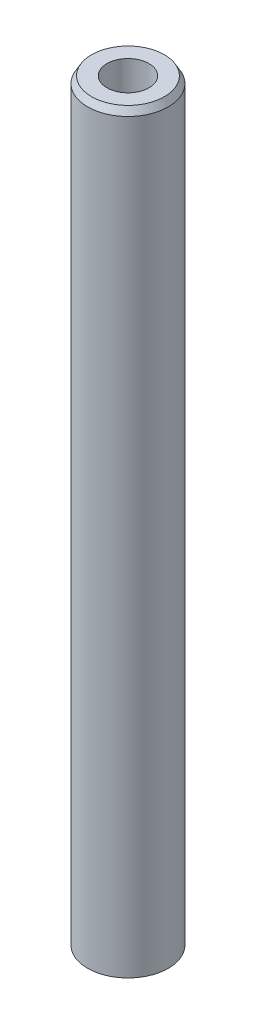
ISO-10303-21;
HEADER;
FILE_DESCRIPTION(('STEP AP214'),'2;1');
FILE_NAME('part.step','',(''),(''),'','','');
FILE_SCHEMA(('AUTOMOTIVE_DESIGN { 1 0 10303 214 1 1 1 1 }'));
ENDSEC;
DATA;
#1=APPLICATION_CONTEXT('core data for automotive mechanical design processes');
#2=APPLICATION_PROTOCOL_DEFINITION('international standard','automotive_design',2000,#1);
#3=PRODUCT_CONTEXT('',#1,'mechanical');
#4=PRODUCT('Part','Part','',(#3));
#5=PRODUCT_RELATED_PRODUCT_CATEGORY('part','',(#4));
#6=PRODUCT_DEFINITION_FORMATION('','',#4);
#7=PRODUCT_DEFINITION_CONTEXT('part definition',#1,'design');
#8=PRODUCT_DEFINITION('design','',#6,#7);
#9=PRODUCT_DEFINITION_SHAPE('','',#8);
#10=(LENGTH_UNIT() NAMED_UNIT(*) SI_UNIT(.MILLI.,.METRE.));
#11=(NAMED_UNIT(*) PLANE_ANGLE_UNIT() SI_UNIT($,.RADIAN.));
#12=(NAMED_UNIT(*) SI_UNIT($,.STERADIAN.) SOLID_ANGLE_UNIT());
#13=UNCERTAINTY_MEASURE_WITH_UNIT(LENGTH_MEASURE(1.E-05),#10,'distance_accuracy_value','');
#14=(GEOMETRIC_REPRESENTATION_CONTEXT(3) GLOBAL_UNCERTAINTY_ASSIGNED_CONTEXT((#13)) GLOBAL_UNIT_ASSIGNED_CONTEXT((#10,
#11,#12)) REPRESENTATION_CONTEXT('',''));
#15=CARTESIAN_POINT('',(0.,0.,0.));
#16=DIRECTION('',(0.,0.,1.));
#17=DIRECTION('',(1.,0.,0.));
#18=AXIS2_PLACEMENT_3D('',#15,#16,#17);
#19=CARTESIAN_POINT('',(0.,93.8489881506741,0.));
#20=DIRECTION('',(0.,-1.,0.));
#21=DIRECTION('',(0.,0.,-1.));
#22=AXIS2_PLACEMENT_3D('',#19,#20,#21);
#23=CYLINDRICAL_SURFACE('',#22,5.);
#24=CARTESIAN_POINT('',(0.,93.0018814613699,0.));
#25=DIRECTION('',(0.,1.,0.));
#26=DIRECTION('',(0.,0.,1.));
#27=AXIS2_PLACEMENT_3D('',#24,#25,#26);
#28=CIRCLE('',#27,5.);
#29=CARTESIAN_POINT('',(0.,93.0018814613699,5.));
#30=VERTEX_POINT('',#29);
#31=EDGE_CURVE('E50',#30,#30,#28,.F.);
#32=ORIENTED_EDGE('',*,*,#31,.T.);
#33=EDGE_LOOP('',(#32));
#34=FACE_BOUND('',#33,.T.);
#35=CARTESIAN_POINT('',(0.,0.489077275102071,0.));
#36=DIRECTION('',(0.,1.,0.));
#37=DIRECTION('',(0.,0.,1.));
#38=AXIS2_PLACEMENT_3D('',#35,#36,#37);
#39=CIRCLE('',#38,5.);
#40=CARTESIAN_POINT('',(0.,0.489077275102071,5.));
#41=VERTEX_POINT('',#40);
#42=EDGE_CURVE('E51',#41,#41,#39,.T.);
#43=ORIENTED_EDGE('',*,*,#42,.T.);
#44=EDGE_LOOP('',(#43));
#45=FACE_BOUND('',#44,.T.);
#46=ADVANCED_FACE('F39',(#34,#45),#23,.T.);
#47=CARTESIAN_POINT('',(0.,93.8489881506741,0.));
#48=DIRECTION('',(0.,1.,0.));
#49=DIRECTION('',(0.,0.,1.));
#50=AXIS2_PLACEMENT_3D('',#47,#48,#49);
#51=PLANE('',#50);
#52=CARTESIAN_POINT('',(0.,93.8489881506741,0.));
#53=DIRECTION('',(0.,1.,0.));
#54=DIRECTION('',(0.,0.,1.));
#55=AXIS2_PLACEMENT_3D('',#52,#53,#54);
#56=CIRCLE('',#55,4.51092272489793);
#57=CARTESIAN_POINT('',(0.,93.8489881506741,4.51092272489793));
#58=VERTEX_POINT('',#57);
#59=EDGE_CURVE('E54',#58,#58,#56,.T.);
#60=ORIENTED_EDGE('',*,*,#59,.T.);
#61=EDGE_LOOP('',(#60));
#62=FACE_BOUND('',#61,.T.);
#63=CARTESIAN_POINT('',(0.,93.8489881506741,0.));
#64=DIRECTION('',(0.,1.,0.));
#65=DIRECTION('',(0.,0.,1.));
#66=AXIS2_PLACEMENT_3D('',#63,#64,#65);
#67=CIRCLE('',#66,2.60659659088661);
#68=CARTESIAN_POINT('',(0.,93.8489881506741,2.60659659088661));
#69=VERTEX_POINT('',#68);
#70=EDGE_CURVE('E58',#69,#69,#67,.T.);
#71=ORIENTED_EDGE('',*,*,#70,.F.);
#72=EDGE_LOOP('',(#71));
#73=FACE_BOUND('',#72,.T.);
#74=ADVANCED_FACE('F69',(#62,#73),#51,.T.);
#75=CARTESIAN_POINT('',(0.,0.,0.));
#76=DIRECTION('',(0.,1.,0.));
#77=DIRECTION('',(0.,0.,1.));
#78=AXIS2_PLACEMENT_3D('',#75,#76,#77);
#79=PLANE('',#78);
#80=CARTESIAN_POINT('',(0.,0.,0.));
#81=DIRECTION('',(0.,1.,0.));
#82=DIRECTION('',(0.,0.,1.));
#83=AXIS2_PLACEMENT_3D('',#80,#81,#82);
#84=CIRCLE('',#83,4.15289331069586);
#85=CARTESIAN_POINT('',(0.,0.,4.15289331069586));
#86=VERTEX_POINT('',#85);
#87=EDGE_CURVE('E10',#86,#86,#84,.F.);
#88=ORIENTED_EDGE('',*,*,#87,.T.);
#89=EDGE_LOOP('',(#88));
#90=FACE_BOUND('',#89,.T.);
#91=CARTESIAN_POINT('',(0.,0.,0.));
#92=DIRECTION('',(0.,1.,0.));
#93=DIRECTION('',(0.,0.,1.));
#94=AXIS2_PLACEMENT_3D('',#91,#92,#93);
#95=CIRCLE('',#94,2.60659659088661);
#96=CARTESIAN_POINT('',(0.,0.,2.60659659088661));
#97=VERTEX_POINT('',#96);
#98=EDGE_CURVE('E63',#97,#97,#95,.T.);
#99=ORIENTED_EDGE('',*,*,#98,.T.);
#100=EDGE_LOOP('',(#99));
#101=FACE_BOUND('',#100,.T.);
#102=ADVANCED_FACE('F75',(#90,#101),#79,.F.);
#103=CARTESIAN_POINT('',(0.,93.8489881506741,0.));
#104=DIRECTION('',(0.,-1.,0.));
#105=DIRECTION('',(0.,0.,-1.));
#106=AXIS2_PLACEMENT_3D('',#103,#104,#105);
#107=CYLINDRICAL_SURFACE('',#106,2.60659659088661);
#108=ORIENTED_EDGE('',*,*,#70,.T.);
#109=EDGE_LOOP('',(#108));
#110=FACE_BOUND('',#109,.T.);
#111=ORIENTED_EDGE('',*,*,#98,.F.);
#112=EDGE_LOOP('',(#111));
#113=FACE_BOUND('',#112,.T.);
#114=ADVANCED_FACE('F70',(#110,#113),#107,.F.);
#115=CARTESIAN_POINT('',(0.,93.8489881506741,0.));
#116=DIRECTION('',(0.,-1.,0.));
#117=DIRECTION('',(0.,0.,-1.));
#118=AXIS2_PLACEMENT_3D('',#115,#116,#117);
#119=CONICAL_SURFACE('',#118,4.51092272489793,0.523598775598288);
#120=ORIENTED_EDGE('',*,*,#31,.F.);
#121=EDGE_LOOP('',(#120));
#122=FACE_BOUND('',#121,.T.);
#123=ORIENTED_EDGE('',*,*,#59,.F.);
#124=EDGE_LOOP('',(#123));
#125=FACE_BOUND('',#124,.T.);
#126=ADVANCED_FACE('F81',(#122,#125),#119,.T.);
#127=CARTESIAN_POINT('',(0.,0.489077275102071,0.));
#128=DIRECTION('',(0.,1.,0.));
#129=DIRECTION('',(0.,0.,1.));
#130=AXIS2_PLACEMENT_3D('',#127,#128,#129);
#131=CONICAL_SURFACE('',#130,5.,1.0471975511966);
#132=ORIENTED_EDGE('',*,*,#87,.F.);
#133=EDGE_LOOP('',(#132));
#134=FACE_BOUND('',#133,.T.);
#135=ORIENTED_EDGE('',*,*,#42,.F.);
#136=EDGE_LOOP('',(#135));
#137=FACE_BOUND('',#136,.T.);
#138=ADVANCED_FACE('F45',(#134,#137),#131,.T.);
#139=CLOSED_SHELL('',(#46,#74,#102,#114,#126,#138));
#140=MANIFOLD_SOLID_BREP('B2',#139);
#141=ADVANCED_BREP_SHAPE_REPRESENTATION('',(#18,#140),#14);
#142=SHAPE_DEFINITION_REPRESENTATION(#9,#141);
ENDSEC;
END-ISO-10303-21;
